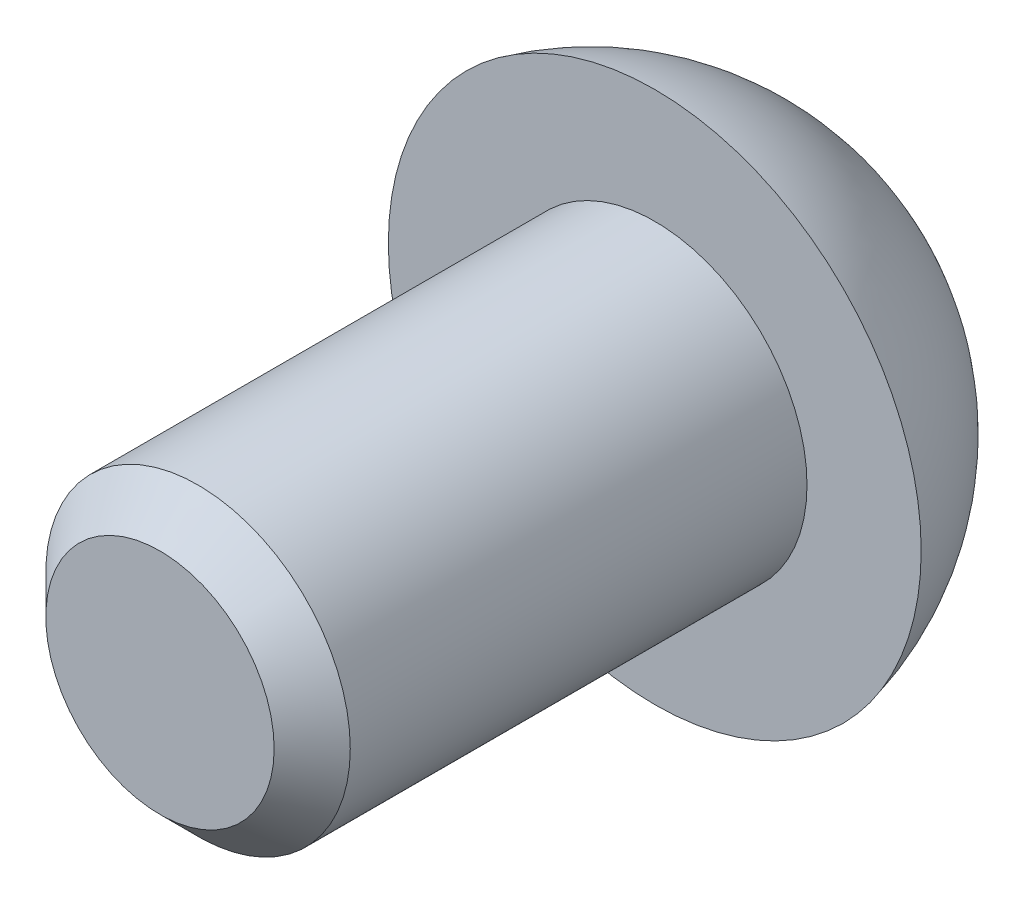
ISO-10303-21;
HEADER;
FILE_DESCRIPTION(('STEP AP214'),'2;1');
FILE_NAME('part.step','',(''),(''),'','','');
FILE_SCHEMA(('AUTOMOTIVE_DESIGN { 1 0 10303 214 1 1 1 1 }'));
ENDSEC;
DATA;
#1=APPLICATION_CONTEXT('core data for automotive mechanical design processes');
#2=APPLICATION_PROTOCOL_DEFINITION('international standard','automotive_design',2000,#1);
#3=PRODUCT_CONTEXT('',#1,'mechanical');
#4=PRODUCT('Part','Part','',(#3));
#5=PRODUCT_RELATED_PRODUCT_CATEGORY('part','',(#4));
#6=PRODUCT_DEFINITION_FORMATION('','',#4);
#7=PRODUCT_DEFINITION_CONTEXT('part definition',#1,'design');
#8=PRODUCT_DEFINITION('design','',#6,#7);
#9=PRODUCT_DEFINITION_SHAPE('','',#8);
#10=(LENGTH_UNIT() NAMED_UNIT(*) SI_UNIT(.MILLI.,.METRE.));
#11=(NAMED_UNIT(*) PLANE_ANGLE_UNIT() SI_UNIT($,.RADIAN.));
#12=(NAMED_UNIT(*) SI_UNIT($,.STERADIAN.) SOLID_ANGLE_UNIT());
#13=UNCERTAINTY_MEASURE_WITH_UNIT(LENGTH_MEASURE(1.E-05),#10,'distance_accuracy_value','');
#14=(GEOMETRIC_REPRESENTATION_CONTEXT(3) GLOBAL_UNCERTAINTY_ASSIGNED_CONTEXT((#13)) GLOBAL_UNIT_ASSIGNED_CONTEXT((#10,
#11,#12)) REPRESENTATION_CONTEXT('',''));
#15=CARTESIAN_POINT('',(0.,0.,0.));
#16=DIRECTION('',(0.,0.,1.));
#17=DIRECTION('',(1.,0.,0.));
#18=AXIS2_PLACEMENT_3D('',#15,#16,#17);
#19=CARTESIAN_POINT('',(0.,0.,-6.5));
#20=DIRECTION('',(0.,0.,1.));
#21=DIRECTION('',(1.,0.,0.));
#22=AXIS2_PLACEMENT_3D('',#19,#20,#21);
#23=CYLINDRICAL_SURFACE('',#22,2.);
#24=CARTESIAN_POINT('',(0.,0.,-0.499999999999998));
#25=DIRECTION('',(0.,0.,1.));
#26=DIRECTION('',(1.,0.,0.));
#27=AXIS2_PLACEMENT_3D('',#24,#25,#26);
#28=CIRCLE('',#27,2.);
#29=CARTESIAN_POINT('',(2.,0.,-0.499999999999998));
#30=VERTEX_POINT('',#29);
#31=EDGE_CURVE('E10',#30,#30,#28,.F.);
#32=ORIENTED_EDGE('',*,*,#31,.T.);
#33=EDGE_LOOP('',(#32));
#34=FACE_BOUND('',#33,.T.);
#35=CARTESIAN_POINT('',(0.,0.,-6.5));
#36=DIRECTION('',(0.,0.,-1.));
#37=DIRECTION('',(-1.,0.,0.));
#38=AXIS2_PLACEMENT_3D('',#35,#36,#37);
#39=CIRCLE('',#38,2.);
#40=CARTESIAN_POINT('',(-2.,0.,-6.5));
#41=VERTEX_POINT('',#40);
#42=EDGE_CURVE('E51',#41,#41,#39,.F.);
#43=ORIENTED_EDGE('',*,*,#42,.T.);
#44=EDGE_LOOP('',(#43));
#45=FACE_BOUND('',#44,.T.);
#46=ADVANCED_FACE('F39',(#34,#45),#23,.T.);
#47=CARTESIAN_POINT('',(0.,0.,0.));
#48=DIRECTION('',(0.,0.,1.));
#49=DIRECTION('',(1.,0.,0.));
#50=AXIS2_PLACEMENT_3D('',#47,#48,#49);
#51=PLANE('',#50);
#52=CARTESIAN_POINT('',(0.,0.,0.));
#53=DIRECTION('',(0.,0.,1.));
#54=DIRECTION('',(1.,0.,0.));
#55=AXIS2_PLACEMENT_3D('',#52,#53,#54);
#56=CIRCLE('',#55,1.5);
#57=CARTESIAN_POINT('',(1.5,0.,0.));
#58=VERTEX_POINT('',#57);
#59=EDGE_CURVE('E47',#58,#58,#56,.T.);
#60=ORIENTED_EDGE('',*,*,#59,.T.);
#61=EDGE_LOOP('',(#60));
#62=FACE_BOUND('',#61,.T.);
#63=ADVANCED_FACE('F72',(#62),#51,.T.);
#64=CARTESIAN_POINT('',(0.,0.,0.));
#65=DIRECTION('',(0.,0.,-1.));
#66=DIRECTION('',(-1.,0.,0.));
#67=AXIS2_PLACEMENT_3D('',#64,#65,#66);
#68=CONICAL_SURFACE('',#67,1.5,0.785398163397447);
#69=ORIENTED_EDGE('',*,*,#31,.F.);
#70=EDGE_LOOP('',(#69));
#71=FACE_BOUND('',#70,.T.);
#72=ORIENTED_EDGE('',*,*,#59,.F.);
#73=EDGE_LOOP('',(#72));
#74=FACE_BOUND('',#73,.T.);
#75=ADVANCED_FACE('F42',(#71,#74),#68,.T.);
#76=CARTESIAN_POINT('',(0.,0.,-5.65738502268236));
#77=DIRECTION('',(0.,0.,1.));
#78=DIRECTION('',(0.,1.,0.));
#79=AXIS2_PLACEMENT_3D('',#76,#77,#78);
#80=SPHERICAL_SURFACE('',#79,3.6);
#81=CARTESIAN_POINT('',(0.,0.,-6.5));
#82=DIRECTION('',(0.,0.,1.));
#83=DIRECTION('',(1.,0.,0.));
#84=AXIS2_PLACEMENT_3D('',#81,#82,#83);
#85=CIRCLE('',#84,3.5);
#86=CARTESIAN_POINT('',(3.5,0.,-6.5));
#87=VERTEX_POINT('',#86);
#88=EDGE_CURVE('E55',#87,#87,#85,.T.);
#89=ORIENTED_EDGE('',*,*,#88,.F.);
#90=EDGE_LOOP('',(#89));
#91=FACE_BOUND('',#90,.T.);
#92=ADVANCED_FACE('F63',(#91),#80,.T.);
#93=CARTESIAN_POINT('',(0.,0.,-6.5));
#94=DIRECTION('',(0.,0.,-1.));
#95=DIRECTION('',(-1.,0.,0.));
#96=AXIS2_PLACEMENT_3D('',#93,#94,#95);
#97=PLANE('',#96);
#98=ORIENTED_EDGE('',*,*,#42,.F.);
#99=EDGE_LOOP('',(#98));
#100=FACE_BOUND('',#99,.T.);
#101=ORIENTED_EDGE('',*,*,#88,.T.);
#102=EDGE_LOOP('',(#101));
#103=FACE_BOUND('',#102,.T.);
#104=ADVANCED_FACE('F61',(#100,#103),#97,.F.);
#105=CLOSED_SHELL('',(#46,#63,#75,#92,#104));
#106=MANIFOLD_SOLID_BREP('B2',#105);
#107=ADVANCED_BREP_SHAPE_REPRESENTATION('',(#18,#106),#14);
#108=SHAPE_DEFINITION_REPRESENTATION(#9,#107);
ENDSEC;
END-ISO-10303-21;
